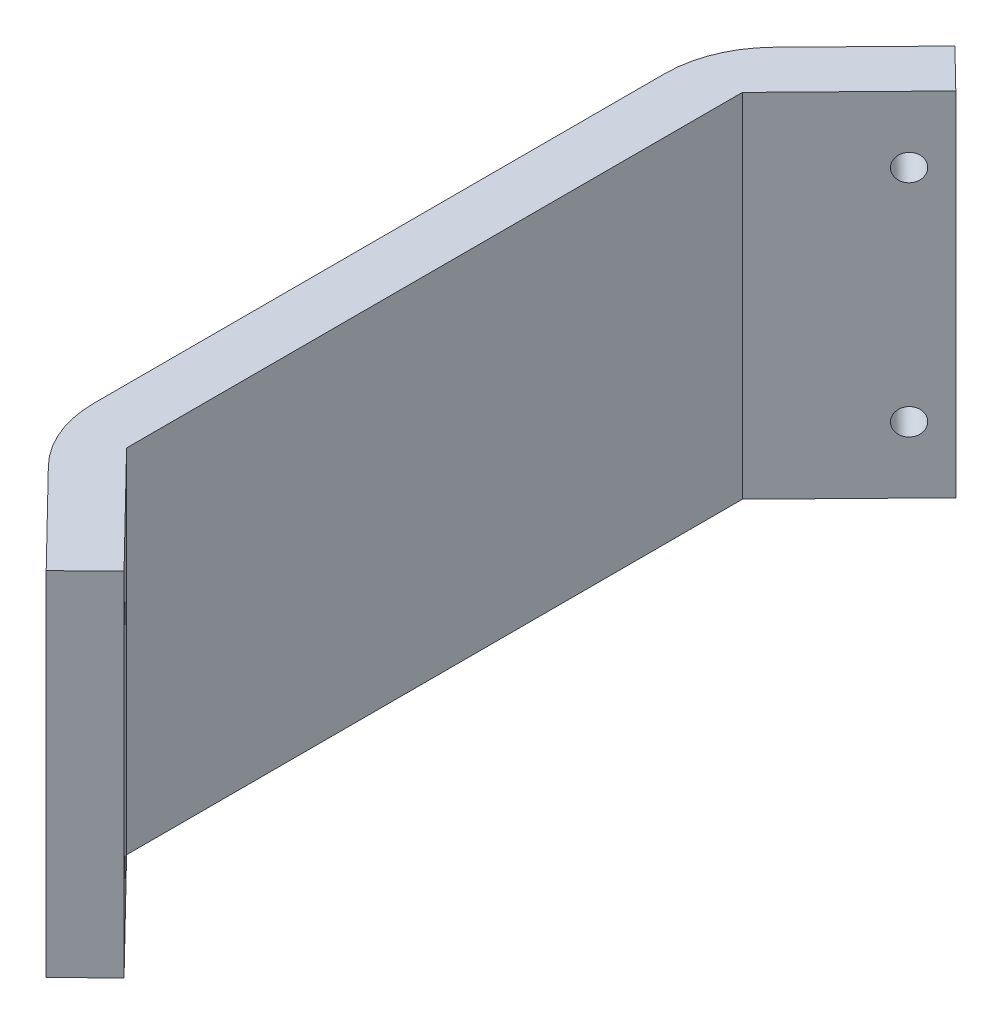
ISO-10303-21;
HEADER;
FILE_DESCRIPTION(('STEP AP214'),'2;1');
FILE_NAME('part.step','',(''),(''),'','','');
FILE_SCHEMA(('AUTOMOTIVE_DESIGN { 1 0 10303 214 1 1 1 1 }'));
ENDSEC;
DATA;
#1=APPLICATION_CONTEXT('core data for automotive mechanical design processes');
#2=APPLICATION_PROTOCOL_DEFINITION('international standard','automotive_design',2000,#1);
#3=PRODUCT_CONTEXT('',#1,'mechanical');
#4=PRODUCT('Part','Part','',(#3));
#5=PRODUCT_RELATED_PRODUCT_CATEGORY('part','',(#4));
#6=PRODUCT_DEFINITION_FORMATION('','',#4);
#7=PRODUCT_DEFINITION_CONTEXT('part definition',#1,'design');
#8=PRODUCT_DEFINITION('design','',#6,#7);
#9=PRODUCT_DEFINITION_SHAPE('','',#8);
#10=(LENGTH_UNIT() NAMED_UNIT(*) SI_UNIT(.MILLI.,.METRE.));
#11=(NAMED_UNIT(*) PLANE_ANGLE_UNIT() SI_UNIT($,.RADIAN.));
#12=(NAMED_UNIT(*) SI_UNIT($,.STERADIAN.) SOLID_ANGLE_UNIT());
#13=UNCERTAINTY_MEASURE_WITH_UNIT(LENGTH_MEASURE(1.E-05),#10,'distance_accuracy_value','');
#14=(GEOMETRIC_REPRESENTATION_CONTEXT(3) GLOBAL_UNCERTAINTY_ASSIGNED_CONTEXT((#13)) GLOBAL_UNIT_ASSIGNED_CONTEXT((#10,
#11,#12)) REPRESENTATION_CONTEXT('',''));
#15=CARTESIAN_POINT('',(0.,0.,0.));
#16=DIRECTION('',(0.,0.,1.));
#17=DIRECTION('',(1.,0.,0.));
#18=AXIS2_PLACEMENT_3D('',#15,#16,#17);
#19=CARTESIAN_POINT('',(0.,32.,-30.));
#20=DIRECTION('',(0.715474021164313,0.,0.698639338313388));
#21=DIRECTION('',(0.698639338313388,0.,-0.715474021164313));
#22=AXIS2_PLACEMENT_3D('',#19,#20,#21);
#23=PLANE('',#22);
#24=CARTESIAN_POINT('',(8.90408198505983,26.,-39.1186381774709));
#25=DIRECTION('',(-0.715474021164313,0.,-0.698639338313388));
#26=DIRECTION('',(-0.698639338313388,0.,0.715474021164313));
#27=AXIS2_PLACEMENT_3D('',#24,#25,#26);
#28=CIRCLE('',#27,1.2);
#29=CARTESIAN_POINT('',(8.06571477908377,26.,-38.2600693520737));
#30=VERTEX_POINT('',#29);
#31=EDGE_CURVE('E171',#30,#30,#28,.T.);
#32=ORIENTED_EDGE('',*,*,#31,.F.);
#33=EDGE_LOOP('',(#32));
#34=FACE_BOUND('',#33,.T.);
#35=CARTESIAN_POINT('',(8.90408198505983,6.,-39.1186381774709));
#36=DIRECTION('',(-0.715474021164313,0.,-0.698639338313388));
#37=DIRECTION('',(0.698639338313388,0.,-0.715474021164313));
#38=AXIS2_PLACEMENT_3D('',#35,#36,#37);
#39=CIRCLE('',#38,1.2);
#40=CARTESIAN_POINT('',(9.74244919103589,6.,-39.9772070028681));
#41=VERTEX_POINT('',#40);
#42=EDGE_CURVE('E180',#41,#41,#39,.T.);
#43=ORIENTED_EDGE('',*,*,#42,.F.);
#44=EDGE_LOOP('',(#43));
#45=FACE_BOUND('',#44,.T.);
#46=DIRECTION('',(0.,1.,0.));
#47=VECTOR('',#46,1.);
#48=CARTESIAN_POINT('',(11.,0.,-41.2650602409638));
#49=LINE('',#48,#47);
#50=CARTESIAN_POINT('',(11.,0.,-41.2650602409638));
#51=VERTEX_POINT('',#50);
#52=CARTESIAN_POINT('',(11.,32.,-41.2650602409638));
#53=VERTEX_POINT('',#52);
#54=EDGE_CURVE('E199',#51,#53,#49,.T.);
#55=ORIENTED_EDGE('',*,*,#54,.F.);
#56=DIRECTION('',(-0.698639338313388,0.,0.715474021164313));
#57=VECTOR('',#56,1.);
#58=CARTESIAN_POINT('',(0.,0.,-30.));
#59=LINE('',#58,#57);
#60=CARTESIAN_POINT('',(2.84525978835686,0.,-32.9138202651847));
#61=VERTEX_POINT('',#60);
#62=EDGE_CURVE('E128',#51,#61,#59,.T.);
#63=ORIENTED_EDGE('',*,*,#62,.T.);
#64=DIRECTION('',(0.,-1.,0.));
#65=VECTOR('',#64,1.);
#66=CARTESIAN_POINT('',(2.84525978835686,32.,-32.9138202651847));
#67=LINE('',#66,#65);
#68=CARTESIAN_POINT('',(2.84525978835686,32.,-32.9138202651847));
#69=VERTEX_POINT('',#68);
#70=EDGE_CURVE('E161',#61,#69,#67,.F.);
#71=ORIENTED_EDGE('',*,*,#70,.T.);
#72=DIRECTION('',(-0.698639338313388,0.,0.715474021164313));
#73=VECTOR('',#72,1.);
#74=CARTESIAN_POINT('',(0.,32.,-30.));
#75=LINE('',#74,#73);
#76=EDGE_CURVE('E144',#53,#69,#75,.T.);
#77=ORIENTED_EDGE('',*,*,#76,.F.);
#78=EDGE_LOOP('',(#55,#63,#71,#77));
#79=FACE_BOUND('',#78,.T.);
#80=ADVANCED_FACE('F34',(#34,#45,#79),#23,.F.);
#81=CARTESIAN_POINT('',(0.,32.,30.));
#82=DIRECTION('',(0.715474021164313,0.,-0.698639338313388));
#83=DIRECTION('',(-0.698639338313388,0.,-0.715474021164313));
#84=AXIS2_PLACEMENT_3D('',#81,#82,#83);
#85=PLANE('',#84);
#86=CARTESIAN_POINT('',(8.90408198505983,26.,39.1186381774709));
#87=DIRECTION('',(-0.715474021164313,0.,0.698639338313388));
#88=DIRECTION('',(0.698639338313388,0.,0.715474021164313));
#89=AXIS2_PLACEMENT_3D('',#86,#87,#88);
#90=CIRCLE('',#89,1.2);
#91=CARTESIAN_POINT('',(9.7424491910359,26.,39.9772070028681));
#92=VERTEX_POINT('',#91);
#93=EDGE_CURVE('E176',#92,#92,#90,.T.);
#94=ORIENTED_EDGE('',*,*,#93,.F.);
#95=EDGE_LOOP('',(#94));
#96=FACE_BOUND('',#95,.T.);
#97=CARTESIAN_POINT('',(8.90408198505983,6.,39.1186381774709));
#98=DIRECTION('',(-0.715474021164313,0.,0.698639338313388));
#99=DIRECTION('',(-0.698639338313388,0.,-0.715474021164313));
#100=AXIS2_PLACEMENT_3D('',#97,#98,#99);
#101=CIRCLE('',#100,1.2);
#102=CARTESIAN_POINT('',(8.06571477908377,6.,38.2600693520737));
#103=VERTEX_POINT('',#102);
#104=EDGE_CURVE('E182',#103,#103,#101,.T.);
#105=ORIENTED_EDGE('',*,*,#104,.F.);
#106=EDGE_LOOP('',(#105));
#107=FACE_BOUND('',#106,.T.);
#108=DIRECTION('',(0.,1.,0.));
#109=VECTOR('',#108,1.);
#110=CARTESIAN_POINT('',(11.,0.,41.2650602409638));
#111=LINE('',#110,#109);
#112=CARTESIAN_POINT('',(11.,0.,41.2650602409638));
#113=VERTEX_POINT('',#112);
#114=CARTESIAN_POINT('',(11.,32.,41.2650602409638));
#115=VERTEX_POINT('',#114);
#116=EDGE_CURVE('E51',#113,#115,#111,.T.);
#117=ORIENTED_EDGE('',*,*,#116,.T.);
#118=DIRECTION('',(0.698639338313388,0.,0.715474021164313));
#119=VECTOR('',#118,1.);
#120=CARTESIAN_POINT('',(0.,32.,30.));
#121=LINE('',#120,#119);
#122=CARTESIAN_POINT('',(2.84525978835688,32.,32.9138202651847));
#123=VERTEX_POINT('',#122);
#124=EDGE_CURVE('E206',#123,#115,#121,.T.);
#125=ORIENTED_EDGE('',*,*,#124,.F.);
#126=DIRECTION('',(0.,-1.,0.));
#127=VECTOR('',#126,1.);
#128=CARTESIAN_POINT('',(2.84525978835688,32.,32.9138202651847));
#129=LINE('',#128,#127);
#130=CARTESIAN_POINT('',(2.84525978835688,0.,32.9138202651847));
#131=VERTEX_POINT('',#130);
#132=EDGE_CURVE('E11',#123,#131,#129,.T.);
#133=ORIENTED_EDGE('',*,*,#132,.T.);
#134=DIRECTION('',(0.698639338313388,0.,0.715474021164313));
#135=VECTOR('',#134,1.);
#136=CARTESIAN_POINT('',(0.,0.,30.));
#137=LINE('',#136,#135);
#138=EDGE_CURVE('E134',#131,#113,#137,.T.);
#139=ORIENTED_EDGE('',*,*,#138,.T.);
#140=EDGE_LOOP('',(#117,#125,#133,#139));
#141=FACE_BOUND('',#140,.T.);
#142=ADVANCED_FACE('F228',(#96,#107,#141),#85,.F.);
#143=CARTESIAN_POINT('',(5.,32.,27.9637134410254));
#144=DIRECTION('',(-0.715474021164313,0.,0.698639338313388));
#145=DIRECTION('',(0.698639338313388,0.,0.715474021164313));
#146=AXIS2_PLACEMENT_3D('',#143,#144,#145);
#147=PLANE('',#146);
#148=CARTESIAN_POINT('',(12.4814520908814,26.,35.625441485904));
#149=DIRECTION('',(-0.715474021164313,0.,0.698639338313388));
#150=DIRECTION('',(0.698639338313388,0.,0.715474021164313));
#151=AXIS2_PLACEMENT_3D('',#148,#149,#150);
#152=CIRCLE('',#151,1.2);
#153=CARTESIAN_POINT('',(13.3198192968575,26.,36.4840103113011));
#154=VERTEX_POINT('',#153);
#155=EDGE_CURVE('E38',#154,#154,#152,.T.);
#156=ORIENTED_EDGE('',*,*,#155,.T.);
#157=EDGE_LOOP('',(#156));
#158=FACE_BOUND('',#157,.T.);
#159=CARTESIAN_POINT('',(12.4814520908814,6.,35.625441485904));
#160=DIRECTION('',(-0.715474021164313,0.,0.698639338313388));
#161=DIRECTION('',(0.698639338313388,0.,0.715474021164313));
#162=AXIS2_PLACEMENT_3D('',#159,#160,#161);
#163=CIRCLE('',#162,1.2);
#164=CARTESIAN_POINT('',(13.3198192968575,6.,36.4840103113011));
#165=VERTEX_POINT('',#164);
#166=EDGE_CURVE('E174',#165,#165,#163,.T.);
#167=ORIENTED_EDGE('',*,*,#166,.T.);
#168=EDGE_LOOP('',(#167));
#169=FACE_BOUND('',#168,.T.);
#170=DIRECTION('',(0.,1.,0.));
#171=VECTOR('',#170,1.);
#172=CARTESIAN_POINT('',(14.5773701058216,0.,37.7718635493969));
#173=LINE('',#172,#171);
#174=CARTESIAN_POINT('',(14.5773701058216,0.,37.7718635493969));
#175=VERTEX_POINT('',#174);
#176=CARTESIAN_POINT('',(14.5773701058216,32.,37.7718635493969));
#177=VERTEX_POINT('',#176);
#178=EDGE_CURVE('E113',#175,#177,#173,.T.);
#179=ORIENTED_EDGE('',*,*,#178,.F.);
#180=DIRECTION('',(-0.698639338313388,0.,-0.715474021164313));
#181=VECTOR('',#180,1.);
#182=CARTESIAN_POINT('',(5.,0.,27.9637134410254));
#183=LINE('',#182,#181);
#184=CARTESIAN_POINT('',(5.,0.,27.9637134410254));
#185=VERTEX_POINT('',#184);
#186=EDGE_CURVE('E125',#175,#185,#183,.T.);
#187=ORIENTED_EDGE('',*,*,#186,.T.);
#188=DIRECTION('',(0.,-1.,0.));
#189=VECTOR('',#188,1.);
#190=CARTESIAN_POINT('',(5.,32.,27.9637134410254));
#191=LINE('',#190,#189);
#192=CARTESIAN_POINT('',(5.,32.,27.9637134410254));
#193=VERTEX_POINT('',#192);
#194=EDGE_CURVE('E148',#193,#185,#191,.T.);
#195=ORIENTED_EDGE('',*,*,#194,.F.);
#196=DIRECTION('',(-0.698639338313388,0.,-0.715474021164313));
#197=VECTOR('',#196,1.);
#198=CARTESIAN_POINT('',(5.,32.,27.9637134410254));
#199=LINE('',#198,#197);
#200=EDGE_CURVE('E127',#177,#193,#199,.T.);
#201=ORIENTED_EDGE('',*,*,#200,.F.);
#202=EDGE_LOOP('',(#179,#187,#195,#201));
#203=FACE_BOUND('',#202,.T.);
#204=ADVANCED_FACE('F123',(#158,#169,#203),#147,.F.);
#205=CARTESIAN_POINT('',(5.,32.,-27.9637134410254));
#206=DIRECTION('',(-0.715474021164313,0.,-0.698639338313388));
#207=DIRECTION('',(-0.698639338313388,0.,0.715474021164313));
#208=AXIS2_PLACEMENT_3D('',#205,#206,#207);
#209=PLANE('',#208);
#210=CARTESIAN_POINT('',(12.4814520908814,26.,-35.625441485904));
#211=DIRECTION('',(-0.715474021164313,0.,-0.698639338313388));
#212=DIRECTION('',(-0.698639338313388,0.,0.715474021164313));
#213=AXIS2_PLACEMENT_3D('',#210,#211,#212);
#214=CIRCLE('',#213,1.2);
#215=CARTESIAN_POINT('',(11.6430848849053,26.,-34.7668726605068));
#216=VERTEX_POINT('',#215);
#217=EDGE_CURVE('E170',#216,#216,#214,.T.);
#218=ORIENTED_EDGE('',*,*,#217,.T.);
#219=EDGE_LOOP('',(#218));
#220=FACE_BOUND('',#219,.T.);
#221=CARTESIAN_POINT('',(12.4814520908814,6.,-35.625441485904));
#222=DIRECTION('',(-0.715474021164313,0.,-0.698639338313388));
#223=DIRECTION('',(-0.698639338313388,0.,0.715474021164313));
#224=AXIS2_PLACEMENT_3D('',#221,#222,#223);
#225=CIRCLE('',#224,1.2);
#226=CARTESIAN_POINT('',(11.6430848849053,6.,-34.7668726605068));
#227=VERTEX_POINT('',#226);
#228=EDGE_CURVE('E167',#227,#227,#225,.T.);
#229=ORIENTED_EDGE('',*,*,#228,.T.);
#230=EDGE_LOOP('',(#229));
#231=FACE_BOUND('',#230,.T.);
#232=DIRECTION('',(0.,1.,0.));
#233=VECTOR('',#232,1.);
#234=CARTESIAN_POINT('',(14.5773701058216,0.,-37.7718635493969));
#235=LINE('',#234,#233);
#236=CARTESIAN_POINT('',(14.5773701058215,0.,-37.7718635493969));
#237=VERTEX_POINT('',#236);
#238=CARTESIAN_POINT('',(14.5773701058216,32.,-37.7718635493969));
#239=VERTEX_POINT('',#238);
#240=EDGE_CURVE('E59',#237,#239,#235,.T.);
#241=ORIENTED_EDGE('',*,*,#240,.T.);
#242=DIRECTION('',(0.698639338313388,0.,-0.715474021164313));
#243=VECTOR('',#242,1.);
#244=CARTESIAN_POINT('',(5.,32.,-27.9637134410254));
#245=LINE('',#244,#243);
#246=CARTESIAN_POINT('',(5.,32.,-27.9637134410254));
#247=VERTEX_POINT('',#246);
#248=EDGE_CURVE('E149',#247,#239,#245,.T.);
#249=ORIENTED_EDGE('',*,*,#248,.F.);
#250=DIRECTION('',(0.,-1.,0.));
#251=VECTOR('',#250,1.);
#252=CARTESIAN_POINT('',(5.,32.,-27.9637134410254));
#253=LINE('',#252,#251);
#254=CARTESIAN_POINT('',(5.,0.,-27.9637134410254));
#255=VERTEX_POINT('',#254);
#256=EDGE_CURVE('E145',#247,#255,#253,.T.);
#257=ORIENTED_EDGE('',*,*,#256,.T.);
#258=DIRECTION('',(0.698639338313388,0.,-0.715474021164313));
#259=VECTOR('',#258,1.);
#260=CARTESIAN_POINT('',(5.,0.,-27.9637134410254));
#261=LINE('',#260,#259);
#262=EDGE_CURVE('E136',#255,#237,#261,.T.);
#263=ORIENTED_EDGE('',*,*,#262,.T.);
#264=EDGE_LOOP('',(#241,#249,#257,#263));
#265=FACE_BOUND('',#264,.T.);
#266=ADVANCED_FACE('F236',(#220,#231,#265),#209,.F.);
#267=CARTESIAN_POINT('',(0.,32.,0.));
#268=DIRECTION('',(0.,-1.,0.));
#269=DIRECTION('',(0.,0.,-1.));
#270=AXIS2_PLACEMENT_3D('',#267,#268,#269);
#271=PLANE('',#270);
#272=DIRECTION('',(0.715474021164313,0.,-0.698639338313388));
#273=VECTOR('',#272,1.);
#274=CARTESIAN_POINT('',(14.5773701058216,32.,37.7718635493969));
#275=LINE('',#274,#273);
#276=EDGE_CURVE('E193',#115,#177,#275,.T.);
#277=ORIENTED_EDGE('',*,*,#276,.T.);
#278=ORIENTED_EDGE('',*,*,#200,.T.);
#279=DIRECTION('',(0.,0.,-1.));
#280=VECTOR('',#279,1.);
#281=CARTESIAN_POINT('',(5.,32.,-27.9637134410254));
#282=LINE('',#281,#280);
#283=EDGE_CURVE('E210',#193,#247,#282,.T.);
#284=ORIENTED_EDGE('',*,*,#283,.T.);
#285=ORIENTED_EDGE('',*,*,#248,.T.);
#286=DIRECTION('',(-0.715474021164313,0.,-0.698639338313388));
#287=VECTOR('',#286,1.);
#288=CARTESIAN_POINT('',(14.5773701058216,32.,-37.7718635493969));
#289=LINE('',#288,#287);
#290=EDGE_CURVE('E173',#239,#53,#289,.T.);
#291=ORIENTED_EDGE('',*,*,#290,.T.);
#292=ORIENTED_EDGE('',*,*,#76,.T.);
#293=CARTESIAN_POINT('',(9.99999999999999,32.,-25.9274268820509));
#294=DIRECTION('',(0.,-1.,0.));
#295=DIRECTION('',(0.,0.,-1.));
#296=AXIS2_PLACEMENT_3D('',#293,#294,#295);
#297=CIRCLE('',#296,10.);
#298=CARTESIAN_POINT('',(0.,32.,-25.9274268820509));
#299=VERTEX_POINT('',#298);
#300=EDGE_CURVE('E43',#69,#299,#297,.F.);
#301=ORIENTED_EDGE('',*,*,#300,.T.);
#302=DIRECTION('',(0.,0.,1.));
#303=VECTOR('',#302,1.);
#304=CARTESIAN_POINT('',(0.,32.,0.));
#305=LINE('',#304,#303);
#306=CARTESIAN_POINT('',(0.,32.,25.9274268820509));
#307=VERTEX_POINT('',#306);
#308=EDGE_CURVE('E203',#299,#307,#305,.T.);
#309=ORIENTED_EDGE('',*,*,#308,.T.);
#310=CARTESIAN_POINT('',(10.,32.,25.9274268820509));
#311=DIRECTION('',(0.,-1.,0.));
#312=DIRECTION('',(0.,0.,-1.));
#313=AXIS2_PLACEMENT_3D('',#310,#311,#312);
#314=CIRCLE('',#313,10.);
#315=EDGE_CURVE('E164',#307,#123,#314,.F.);
#316=ORIENTED_EDGE('',*,*,#315,.T.);
#317=ORIENTED_EDGE('',*,*,#124,.T.);
#318=EDGE_LOOP('',(#277,#278,#284,#285,#291,#292,#301,#309,#316,#317));
#319=FACE_BOUND('',#318,.T.);
#320=ADVANCED_FACE('F226',(#319),#271,.F.);
#321=CARTESIAN_POINT('',(0.,0.,0.));
#322=DIRECTION('',(0.,-1.,0.));
#323=DIRECTION('',(0.,0.,-1.));
#324=AXIS2_PLACEMENT_3D('',#321,#322,#323);
#325=PLANE('',#324);
#326=ORIENTED_EDGE('',*,*,#186,.F.);
#327=DIRECTION('',(0.715474021164313,0.,-0.698639338313388));
#328=VECTOR('',#327,1.);
#329=CARTESIAN_POINT('',(14.5773701058216,0.,37.7718635493969));
#330=LINE('',#329,#328);
#331=EDGE_CURVE('E110',#113,#175,#330,.T.);
#332=ORIENTED_EDGE('',*,*,#331,.F.);
#333=ORIENTED_EDGE('',*,*,#138,.F.);
#334=CARTESIAN_POINT('',(10.,0.,25.9274268820509));
#335=DIRECTION('',(0.,-1.,0.));
#336=DIRECTION('',(0.,0.,-1.));
#337=AXIS2_PLACEMENT_3D('',#334,#335,#336);
#338=CIRCLE('',#337,10.);
#339=CARTESIAN_POINT('',(0.,0.,25.9274268820509));
#340=VERTEX_POINT('',#339);
#341=EDGE_CURVE('E156',#131,#340,#338,.T.);
#342=ORIENTED_EDGE('',*,*,#341,.T.);
#343=DIRECTION('',(0.,0.,1.));
#344=VECTOR('',#343,1.);
#345=CARTESIAN_POINT('',(0.,0.,0.));
#346=LINE('',#345,#344);
#347=CARTESIAN_POINT('',(0.,0.,-25.9274268820509));
#348=VERTEX_POINT('',#347);
#349=EDGE_CURVE('E138',#348,#340,#346,.T.);
#350=ORIENTED_EDGE('',*,*,#349,.F.);
#351=CARTESIAN_POINT('',(9.99999999999999,0.,-25.9274268820509));
#352=DIRECTION('',(0.,-1.,0.));
#353=DIRECTION('',(0.,0.,-1.));
#354=AXIS2_PLACEMENT_3D('',#351,#352,#353);
#355=CIRCLE('',#354,10.);
#356=EDGE_CURVE('E158',#348,#61,#355,.T.);
#357=ORIENTED_EDGE('',*,*,#356,.T.);
#358=ORIENTED_EDGE('',*,*,#62,.F.);
#359=DIRECTION('',(-0.715474021164313,0.,-0.698639338313388));
#360=VECTOR('',#359,1.);
#361=CARTESIAN_POINT('',(14.5773701058216,0.,-37.7718635493969));
#362=LINE('',#361,#360);
#363=EDGE_CURVE('E119',#237,#51,#362,.T.);
#364=ORIENTED_EDGE('',*,*,#363,.F.);
#365=ORIENTED_EDGE('',*,*,#262,.F.);
#366=DIRECTION('',(0.,0.,-1.));
#367=VECTOR('',#366,1.);
#368=CARTESIAN_POINT('',(5.,0.,-27.9637134410254));
#369=LINE('',#368,#367);
#370=EDGE_CURVE('E133',#185,#255,#369,.T.);
#371=ORIENTED_EDGE('',*,*,#370,.F.);
#372=EDGE_LOOP('',(#326,#332,#333,#342,#350,#357,#358,#364,#365,#371));
#373=FACE_BOUND('',#372,.T.);
#374=ADVANCED_FACE('F131',(#373),#325,.T.);
#375=CARTESIAN_POINT('',(0.,32.,0.));
#376=DIRECTION('',(1.,0.,0.));
#377=DIRECTION('',(0.,0.,-1.));
#378=AXIS2_PLACEMENT_3D('',#375,#376,#377);
#379=PLANE('',#378);
#380=ORIENTED_EDGE('',*,*,#308,.F.);
#381=DIRECTION('',(0.,-1.,0.));
#382=VECTOR('',#381,1.);
#383=CARTESIAN_POINT('',(0.,32.,-25.9274268820509));
#384=LINE('',#383,#382);
#385=EDGE_CURVE('E153',#299,#348,#384,.T.);
#386=ORIENTED_EDGE('',*,*,#385,.T.);
#387=ORIENTED_EDGE('',*,*,#349,.T.);
#388=DIRECTION('',(0.,-1.,0.));
#389=VECTOR('',#388,1.);
#390=CARTESIAN_POINT('',(0.,32.,25.9274268820509));
#391=LINE('',#390,#389);
#392=EDGE_CURVE('E151',#340,#307,#391,.F.);
#393=ORIENTED_EDGE('',*,*,#392,.T.);
#394=EDGE_LOOP('',(#380,#386,#387,#393));
#395=FACE_BOUND('',#394,.T.);
#396=ADVANCED_FACE('F219',(#395),#379,.F.);
#397=CARTESIAN_POINT('',(5.,32.,-27.9637134410254));
#398=DIRECTION('',(-1.,0.,0.));
#399=DIRECTION('',(0.,0.,1.));
#400=AXIS2_PLACEMENT_3D('',#397,#398,#399);
#401=PLANE('',#400);
#402=ORIENTED_EDGE('',*,*,#370,.T.);
#403=ORIENTED_EDGE('',*,*,#256,.F.);
#404=ORIENTED_EDGE('',*,*,#283,.F.);
#405=ORIENTED_EDGE('',*,*,#194,.T.);
#406=EDGE_LOOP('',(#402,#403,#404,#405));
#407=FACE_BOUND('',#406,.T.);
#408=ADVANCED_FACE('F245',(#407),#401,.F.);
#409=CARTESIAN_POINT('',(9.99999999999999,32.,-25.9274268820509));
#410=DIRECTION('',(0.,-1.,0.));
#411=DIRECTION('',(0.,0.,-1.));
#412=AXIS2_PLACEMENT_3D('',#409,#410,#411);
#413=CYLINDRICAL_SURFACE('',#412,10.);
#414=ORIENTED_EDGE('',*,*,#300,.F.);
#415=ORIENTED_EDGE('',*,*,#70,.F.);
#416=ORIENTED_EDGE('',*,*,#356,.F.);
#417=ORIENTED_EDGE('',*,*,#385,.F.);
#418=EDGE_LOOP('',(#414,#415,#416,#417));
#419=FACE_BOUND('',#418,.T.);
#420=ADVANCED_FACE('F246',(#419),#413,.T.);
#421=CARTESIAN_POINT('',(10.,32.,25.9274268820509));
#422=DIRECTION('',(0.,-1.,0.));
#423=DIRECTION('',(0.,0.,-1.));
#424=AXIS2_PLACEMENT_3D('',#421,#422,#423);
#425=CYLINDRICAL_SURFACE('',#424,10.);
#426=ORIENTED_EDGE('',*,*,#315,.F.);
#427=ORIENTED_EDGE('',*,*,#392,.F.);
#428=ORIENTED_EDGE('',*,*,#341,.F.);
#429=ORIENTED_EDGE('',*,*,#132,.F.);
#430=EDGE_LOOP('',(#426,#427,#428,#429));
#431=FACE_BOUND('',#430,.T.);
#432=ADVANCED_FACE('F36',(#431),#425,.T.);
#433=CARTESIAN_POINT('',(14.5773701058216,0.,-37.7718635493969));
#434=DIRECTION('',(0.698639338313388,0.,-0.715474021164313));
#435=DIRECTION('',(-0.715474021164313,0.,-0.698639338313388));
#436=AXIS2_PLACEMENT_3D('',#433,#434,#435);
#437=PLANE('',#436);
#438=ORIENTED_EDGE('',*,*,#290,.F.);
#439=ORIENTED_EDGE('',*,*,#240,.F.);
#440=ORIENTED_EDGE('',*,*,#363,.T.);
#441=ORIENTED_EDGE('',*,*,#54,.T.);
#442=EDGE_LOOP('',(#438,#439,#440,#441));
#443=FACE_BOUND('',#442,.T.);
#444=ADVANCED_FACE('F253',(#443),#437,.T.);
#445=CARTESIAN_POINT('',(14.5773701058216,0.,37.7718635493969));
#446=DIRECTION('',(0.698639338313388,0.,0.715474021164313));
#447=DIRECTION('',(0.715474021164313,0.,-0.698639338313388));
#448=AXIS2_PLACEMENT_3D('',#445,#446,#447);
#449=PLANE('',#448);
#450=ORIENTED_EDGE('',*,*,#276,.F.);
#451=ORIENTED_EDGE('',*,*,#116,.F.);
#452=ORIENTED_EDGE('',*,*,#331,.T.);
#453=ORIENTED_EDGE('',*,*,#178,.T.);
#454=EDGE_LOOP('',(#450,#451,#452,#453));
#455=FACE_BOUND('',#454,.T.);
#456=ADVANCED_FACE('F112',(#455),#449,.T.);
#457=CARTESIAN_POINT('',(51.9887141952455,6.,2.95223798071041));
#458=DIRECTION('',(-0.715474021164313,0.,-0.698639338313388));
#459=DIRECTION('',(-0.698639338313388,0.,0.715474021164313));
#460=AXIS2_PLACEMENT_3D('',#457,#458,#459);
#461=CYLINDRICAL_SURFACE('',#460,1.2);
#462=ORIENTED_EDGE('',*,*,#42,.T.);
#463=EDGE_LOOP('',(#462));
#464=FACE_BOUND('',#463,.T.);
#465=ORIENTED_EDGE('',*,*,#228,.F.);
#466=EDGE_LOOP('',(#465));
#467=FACE_BOUND('',#466,.T.);
#468=ADVANCED_FACE('F280',(#464,#467),#461,.F.);
#469=CARTESIAN_POINT('',(51.9887141952455,26.,2.95223798071041));
#470=DIRECTION('',(-0.715474021164313,0.,-0.698639338313388));
#471=DIRECTION('',(-0.698639338313388,0.,0.715474021164313));
#472=AXIS2_PLACEMENT_3D('',#469,#470,#471);
#473=CYLINDRICAL_SURFACE('',#472,1.2);
#474=ORIENTED_EDGE('',*,*,#31,.T.);
#475=EDGE_LOOP('',(#474));
#476=FACE_BOUND('',#475,.T.);
#477=ORIENTED_EDGE('',*,*,#217,.F.);
#478=EDGE_LOOP('',(#477));
#479=FACE_BOUND('',#478,.T.);
#480=ADVANCED_FACE('F283',(#476,#479),#473,.F.);
#481=CARTESIAN_POINT('',(51.9887141952455,6.,-2.9522379807104));
#482=DIRECTION('',(-0.715474021164313,0.,0.698639338313388));
#483=DIRECTION('',(0.698639338313388,0.,0.715474021164313));
#484=AXIS2_PLACEMENT_3D('',#481,#482,#483);
#485=CYLINDRICAL_SURFACE('',#484,1.2);
#486=ORIENTED_EDGE('',*,*,#104,.T.);
#487=EDGE_LOOP('',(#486));
#488=FACE_BOUND('',#487,.T.);
#489=ORIENTED_EDGE('',*,*,#166,.F.);
#490=EDGE_LOOP('',(#489));
#491=FACE_BOUND('',#490,.T.);
#492=ADVANCED_FACE('F287',(#488,#491),#485,.F.);
#493=CARTESIAN_POINT('',(51.9887141952455,26.,-2.9522379807104));
#494=DIRECTION('',(-0.715474021164313,0.,0.698639338313388));
#495=DIRECTION('',(0.698639338313388,0.,0.715474021164313));
#496=AXIS2_PLACEMENT_3D('',#493,#494,#495);
#497=CYLINDRICAL_SURFACE('',#496,1.2);
#498=ORIENTED_EDGE('',*,*,#93,.T.);
#499=EDGE_LOOP('',(#498));
#500=FACE_BOUND('',#499,.T.);
#501=ORIENTED_EDGE('',*,*,#155,.F.);
#502=EDGE_LOOP('',(#501));
#503=FACE_BOUND('',#502,.T.);
#504=ADVANCED_FACE('F291',(#500,#503),#497,.F.);
#505=CLOSED_SHELL('',(#80,#142,#204,#266,#320,#374,#396,#408,#420,#432,#444,#456,#468,#480,#492,#504));
#506=MANIFOLD_SOLID_BREP('B2',#505);
#507=ADVANCED_BREP_SHAPE_REPRESENTATION('',(#18,#506),#14);
#508=SHAPE_DEFINITION_REPRESENTATION(#9,#507);
ENDSEC;
END-ISO-10303-21;
